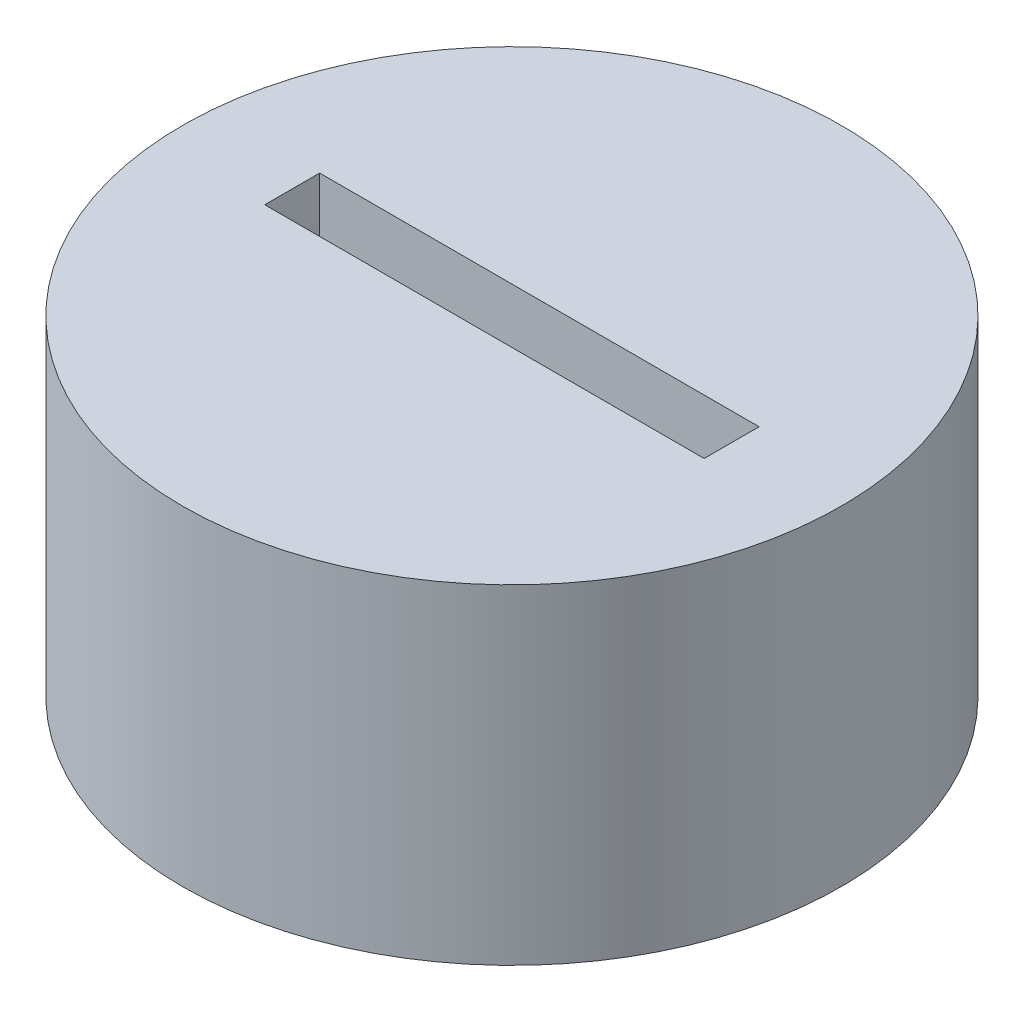
ISO-10303-21;
HEADER;
FILE_DESCRIPTION(('STEP AP214'),'2;1');
FILE_NAME('part.step','',(''),(''),'','','');
FILE_SCHEMA(('AUTOMOTIVE_DESIGN { 1 0 10303 214 1 1 1 1 }'));
ENDSEC;
DATA;
#1=APPLICATION_CONTEXT('core data for automotive mechanical design processes');
#2=APPLICATION_PROTOCOL_DEFINITION('international standard','automotive_design',2000,#1);
#3=PRODUCT_CONTEXT('',#1,'mechanical');
#4=PRODUCT('Part','Part','',(#3));
#5=PRODUCT_RELATED_PRODUCT_CATEGORY('part','',(#4));
#6=PRODUCT_DEFINITION_FORMATION('','',#4);
#7=PRODUCT_DEFINITION_CONTEXT('part definition',#1,'design');
#8=PRODUCT_DEFINITION('design','',#6,#7);
#9=PRODUCT_DEFINITION_SHAPE('','',#8);
#10=(LENGTH_UNIT() NAMED_UNIT(*) SI_UNIT(.MILLI.,.METRE.));
#11=(NAMED_UNIT(*) PLANE_ANGLE_UNIT() SI_UNIT($,.RADIAN.));
#12=(NAMED_UNIT(*) SI_UNIT($,.STERADIAN.) SOLID_ANGLE_UNIT());
#13=UNCERTAINTY_MEASURE_WITH_UNIT(LENGTH_MEASURE(1.E-05),#10,'distance_accuracy_value','');
#14=(GEOMETRIC_REPRESENTATION_CONTEXT(3) GLOBAL_UNCERTAINTY_ASSIGNED_CONTEXT((#13)) GLOBAL_UNIT_ASSIGNED_CONTEXT((#10,
#11,#12)) REPRESENTATION_CONTEXT('',''));
#15=CARTESIAN_POINT('',(0.,0.,0.));
#16=DIRECTION('',(0.,0.,1.));
#17=DIRECTION('',(1.,0.,0.));
#18=AXIS2_PLACEMENT_3D('',#15,#16,#17);
#19=CARTESIAN_POINT('',(0.,6.,0.));
#20=DIRECTION('',(0.,-1.,0.));
#21=DIRECTION('',(0.,0.,-1.));
#22=AXIS2_PLACEMENT_3D('',#19,#20,#21);
#23=CYLINDRICAL_SURFACE('',#22,6.);
#24=CARTESIAN_POINT('',(0.,6.,0.));
#25=DIRECTION('',(0.,1.,0.));
#26=DIRECTION('',(0.,0.,1.));
#27=AXIS2_PLACEMENT_3D('',#24,#25,#26);
#28=CIRCLE('',#27,6.);
#29=CARTESIAN_POINT('',(0.,6.,6.));
#30=VERTEX_POINT('',#29);
#31=EDGE_CURVE('E11',#30,#30,#28,.T.);
#32=ORIENTED_EDGE('',*,*,#31,.F.);
#33=EDGE_LOOP('',(#32));
#34=FACE_BOUND('',#33,.T.);
#35=CARTESIAN_POINT('',(0.,0.,0.));
#36=DIRECTION('',(0.,1.,0.));
#37=DIRECTION('',(0.,0.,1.));
#38=AXIS2_PLACEMENT_3D('',#35,#36,#37);
#39=CIRCLE('',#38,6.);
#40=CARTESIAN_POINT('',(0.,0.,6.));
#41=VERTEX_POINT('',#40);
#42=EDGE_CURVE('E39',#41,#41,#39,.T.);
#43=ORIENTED_EDGE('',*,*,#42,.T.);
#44=EDGE_LOOP('',(#43));
#45=FACE_BOUND('',#44,.T.);
#46=ADVANCED_FACE('F36',(#34,#45),#23,.T.);
#47=CARTESIAN_POINT('',(0.,6.,0.));
#48=DIRECTION('',(0.,1.,0.));
#49=DIRECTION('',(0.,0.,1.));
#50=AXIS2_PLACEMENT_3D('',#47,#48,#49);
#51=PLANE('',#50);
#52=DIRECTION('',(0.,0.,-1.));
#53=VECTOR('',#52,1.);
#54=CARTESIAN_POINT('',(4.,6.,0.5));
#55=LINE('',#54,#53);
#56=CARTESIAN_POINT('',(4.,6.,0.5));
#57=VERTEX_POINT('',#56);
#58=CARTESIAN_POINT('',(4.,6.,-0.5));
#59=VERTEX_POINT('',#58);
#60=EDGE_CURVE('E58',#57,#59,#55,.T.);
#61=ORIENTED_EDGE('',*,*,#60,.F.);
#62=DIRECTION('',(1.,0.,0.));
#63=VECTOR('',#62,1.);
#64=CARTESIAN_POINT('',(-4.,6.,0.5));
#65=LINE('',#64,#63);
#66=CARTESIAN_POINT('',(-4.,6.,0.5));
#67=VERTEX_POINT('',#66);
#68=EDGE_CURVE('E142',#67,#57,#65,.T.);
#69=ORIENTED_EDGE('',*,*,#68,.F.);
#70=DIRECTION('',(0.,0.,1.));
#71=VECTOR('',#70,1.);
#72=CARTESIAN_POINT('',(-4.,6.,0.5));
#73=LINE('',#72,#71);
#74=CARTESIAN_POINT('',(-4.,6.,-0.5));
#75=VERTEX_POINT('',#74);
#76=EDGE_CURVE('E156',#75,#67,#73,.T.);
#77=ORIENTED_EDGE('',*,*,#76,.F.);
#78=DIRECTION('',(-1.,0.,0.));
#79=VECTOR('',#78,1.);
#80=CARTESIAN_POINT('',(-4.,6.,-0.5));
#81=LINE('',#80,#79);
#82=EDGE_CURVE('E153',#59,#75,#81,.T.);
#83=ORIENTED_EDGE('',*,*,#82,.F.);
#84=EDGE_LOOP('',(#61,#69,#77,#83));
#85=FACE_BOUND('',#84,.T.);
#86=ORIENTED_EDGE('',*,*,#31,.T.);
#87=EDGE_LOOP('',(#86));
#88=FACE_BOUND('',#87,.T.);
#89=ADVANCED_FACE('F174',(#85,#88),#51,.T.);
#90=CARTESIAN_POINT('',(0.,0.,0.));
#91=DIRECTION('',(0.,1.,0.));
#92=DIRECTION('',(0.,0.,1.));
#93=AXIS2_PLACEMENT_3D('',#90,#91,#92);
#94=PLANE('',#93);
#95=DIRECTION('',(-1.,0.,0.));
#96=VECTOR('',#95,1.);
#97=CARTESIAN_POINT('',(-0.5,0.,4.));
#98=LINE('',#97,#96);
#99=CARTESIAN_POINT('',(0.5,0.,4.));
#100=VERTEX_POINT('',#99);
#101=CARTESIAN_POINT('',(-0.5,0.,4.));
#102=VERTEX_POINT('',#101);
#103=EDGE_CURVE('E129',#100,#102,#98,.T.);
#104=ORIENTED_EDGE('',*,*,#103,.F.);
#105=DIRECTION('',(0.,0.,1.));
#106=VECTOR('',#105,1.);
#107=CARTESIAN_POINT('',(0.5,0.,4.));
#108=LINE('',#107,#106);
#109=CARTESIAN_POINT('',(0.500000000000001,0.,-4.));
#110=VERTEX_POINT('',#109);
#111=EDGE_CURVE('E50',#110,#100,#108,.T.);
#112=ORIENTED_EDGE('',*,*,#111,.F.);
#113=DIRECTION('',(1.,0.,0.));
#114=VECTOR('',#113,1.);
#115=CARTESIAN_POINT('',(-0.499999999999999,0.,-4.));
#116=LINE('',#115,#114);
#117=CARTESIAN_POINT('',(-0.499999999999999,0.,-4.));
#118=VERTEX_POINT('',#117);
#119=EDGE_CURVE('E120',#118,#110,#116,.T.);
#120=ORIENTED_EDGE('',*,*,#119,.F.);
#121=DIRECTION('',(0.,0.,-1.));
#122=VECTOR('',#121,1.);
#123=CARTESIAN_POINT('',(-0.5,0.,4.));
#124=LINE('',#123,#122);
#125=EDGE_CURVE('E123',#102,#118,#124,.T.);
#126=ORIENTED_EDGE('',*,*,#125,.F.);
#127=EDGE_LOOP('',(#104,#112,#120,#126));
#128=FACE_BOUND('',#127,.T.);
#129=ORIENTED_EDGE('',*,*,#42,.F.);
#130=EDGE_LOOP('',(#129));
#131=FACE_BOUND('',#130,.T.);
#132=ADVANCED_FACE('F193',(#128,#131),#94,.F.);
#133=CARTESIAN_POINT('',(4.,4.5,0.5));
#134=DIRECTION('',(1.,0.,0.));
#135=DIRECTION('',(0.,0.,-1.));
#136=AXIS2_PLACEMENT_3D('',#133,#134,#135);
#137=PLANE('',#136);
#138=ORIENTED_EDGE('',*,*,#60,.T.);
#139=DIRECTION('',(0.,1.,0.));
#140=VECTOR('',#139,1.);
#141=CARTESIAN_POINT('',(4.,4.5,-0.5));
#142=LINE('',#141,#140);
#143=CARTESIAN_POINT('',(4.,4.5,-0.5));
#144=VERTEX_POINT('',#143);
#145=EDGE_CURVE('E151',#144,#59,#142,.T.);
#146=ORIENTED_EDGE('',*,*,#145,.F.);
#147=DIRECTION('',(0.,0.,-1.));
#148=VECTOR('',#147,1.);
#149=CARTESIAN_POINT('',(4.,4.5,0.5));
#150=LINE('',#149,#148);
#151=CARTESIAN_POINT('',(4.,4.5,0.5));
#152=VERTEX_POINT('',#151);
#153=EDGE_CURVE('E138',#152,#144,#150,.T.);
#154=ORIENTED_EDGE('',*,*,#153,.F.);
#155=DIRECTION('',(0.,1.,0.));
#156=VECTOR('',#155,1.);
#157=CARTESIAN_POINT('',(4.,4.5,0.5));
#158=LINE('',#157,#156);
#159=EDGE_CURVE('E161',#152,#57,#158,.T.);
#160=ORIENTED_EDGE('',*,*,#159,.T.);
#161=EDGE_LOOP('',(#138,#146,#154,#160));
#162=FACE_BOUND('',#161,.T.);
#163=ADVANCED_FACE('F183',(#162),#137,.F.);
#164=CARTESIAN_POINT('',(-4.,4.5,0.5));
#165=DIRECTION('',(0.,0.,1.));
#166=DIRECTION('',(1.,0.,0.));
#167=AXIS2_PLACEMENT_3D('',#164,#165,#166);
#168=PLANE('',#167);
#169=ORIENTED_EDGE('',*,*,#68,.T.);
#170=ORIENTED_EDGE('',*,*,#159,.F.);
#171=DIRECTION('',(1.,0.,0.));
#172=VECTOR('',#171,1.);
#173=CARTESIAN_POINT('',(-4.,4.5,0.5));
#174=LINE('',#173,#172);
#175=CARTESIAN_POINT('',(-4.,4.5,0.5));
#176=VERTEX_POINT('',#175);
#177=EDGE_CURVE('E148',#176,#152,#174,.T.);
#178=ORIENTED_EDGE('',*,*,#177,.F.);
#179=DIRECTION('',(0.,1.,0.));
#180=VECTOR('',#179,1.);
#181=CARTESIAN_POINT('',(-4.,4.5,0.5));
#182=LINE('',#181,#180);
#183=EDGE_CURVE('E163',#176,#67,#182,.T.);
#184=ORIENTED_EDGE('',*,*,#183,.T.);
#185=EDGE_LOOP('',(#169,#170,#178,#184));
#186=FACE_BOUND('',#185,.T.);
#187=ADVANCED_FACE('F185',(#186),#168,.F.);
#188=CARTESIAN_POINT('',(-4.,4.5,0.5));
#189=DIRECTION('',(-1.,0.,0.));
#190=DIRECTION('',(0.,0.,1.));
#191=AXIS2_PLACEMENT_3D('',#188,#189,#190);
#192=PLANE('',#191);
#193=ORIENTED_EDGE('',*,*,#76,.T.);
#194=ORIENTED_EDGE('',*,*,#183,.F.);
#195=DIRECTION('',(0.,0.,1.));
#196=VECTOR('',#195,1.);
#197=CARTESIAN_POINT('',(-4.,4.5,0.5));
#198=LINE('',#197,#196);
#199=CARTESIAN_POINT('',(-4.,4.5,-0.5));
#200=VERTEX_POINT('',#199);
#201=EDGE_CURVE('E145',#200,#176,#198,.T.);
#202=ORIENTED_EDGE('',*,*,#201,.F.);
#203=DIRECTION('',(0.,1.,0.));
#204=VECTOR('',#203,1.);
#205=CARTESIAN_POINT('',(-4.,4.5,-0.5));
#206=LINE('',#205,#204);
#207=EDGE_CURVE('E165',#200,#75,#206,.T.);
#208=ORIENTED_EDGE('',*,*,#207,.T.);
#209=EDGE_LOOP('',(#193,#194,#202,#208));
#210=FACE_BOUND('',#209,.T.);
#211=ADVANCED_FACE('F178',(#210),#192,.F.);
#212=CARTESIAN_POINT('',(-4.,4.5,-0.5));
#213=DIRECTION('',(0.,0.,-1.));
#214=DIRECTION('',(-1.,0.,0.));
#215=AXIS2_PLACEMENT_3D('',#212,#213,#214);
#216=PLANE('',#215);
#217=ORIENTED_EDGE('',*,*,#82,.T.);
#218=ORIENTED_EDGE('',*,*,#207,.F.);
#219=DIRECTION('',(-1.,0.,0.));
#220=VECTOR('',#219,1.);
#221=CARTESIAN_POINT('',(-4.,4.5,-0.5));
#222=LINE('',#221,#220);
#223=EDGE_CURVE('E141',#144,#200,#222,.T.);
#224=ORIENTED_EDGE('',*,*,#223,.F.);
#225=ORIENTED_EDGE('',*,*,#145,.T.);
#226=EDGE_LOOP('',(#217,#218,#224,#225));
#227=FACE_BOUND('',#226,.T.);
#228=ADVANCED_FACE('F170',(#227),#216,.F.);
#229=CARTESIAN_POINT('',(0.,4.5,0.));
#230=DIRECTION('',(0.,-1.,0.));
#231=DIRECTION('',(0.,0.,-1.));
#232=AXIS2_PLACEMENT_3D('',#229,#230,#231);
#233=PLANE('',#232);
#234=ORIENTED_EDGE('',*,*,#153,.T.);
#235=ORIENTED_EDGE('',*,*,#223,.T.);
#236=ORIENTED_EDGE('',*,*,#201,.T.);
#237=ORIENTED_EDGE('',*,*,#177,.T.);
#238=EDGE_LOOP('',(#234,#235,#236,#237));
#239=FACE_BOUND('',#238,.T.);
#240=ADVANCED_FACE('F182',(#239),#233,.F.);
#241=CARTESIAN_POINT('',(0.5,1.5,4.));
#242=DIRECTION('',(1.,0.,0.));
#243=DIRECTION('',(0.,0.,-1.));
#244=AXIS2_PLACEMENT_3D('',#241,#242,#243);
#245=PLANE('',#244);
#246=ORIENTED_EDGE('',*,*,#111,.T.);
#247=DIRECTION('',(0.,-1.,0.));
#248=VECTOR('',#247,1.);
#249=CARTESIAN_POINT('',(0.5,1.5,4.));
#250=LINE('',#249,#248);
#251=CARTESIAN_POINT('',(0.5,1.5,4.));
#252=VERTEX_POINT('',#251);
#253=EDGE_CURVE('E98',#252,#100,#250,.T.);
#254=ORIENTED_EDGE('',*,*,#253,.F.);
#255=DIRECTION('',(0.,0.,1.));
#256=VECTOR('',#255,1.);
#257=CARTESIAN_POINT('',(0.5,1.5,4.));
#258=LINE('',#257,#256);
#259=CARTESIAN_POINT('',(0.500000000000001,1.5,-4.));
#260=VERTEX_POINT('',#259);
#261=EDGE_CURVE('E102',#260,#252,#258,.T.);
#262=ORIENTED_EDGE('',*,*,#261,.F.);
#263=DIRECTION('',(0.,-1.,0.));
#264=VECTOR('',#263,1.);
#265=CARTESIAN_POINT('',(0.500000000000001,1.5,-4.));
#266=LINE('',#265,#264);
#267=EDGE_CURVE('E133',#260,#110,#266,.T.);
#268=ORIENTED_EDGE('',*,*,#267,.T.);
#269=EDGE_LOOP('',(#246,#254,#262,#268));
#270=FACE_BOUND('',#269,.T.);
#271=ADVANCED_FACE('F100',(#270),#245,.F.);
#272=CARTESIAN_POINT('',(-0.499999999999999,1.5,-4.));
#273=DIRECTION('',(0.,0.,-1.));
#274=DIRECTION('',(-1.,0.,0.));
#275=AXIS2_PLACEMENT_3D('',#272,#273,#274);
#276=PLANE('',#275);
#277=ORIENTED_EDGE('',*,*,#119,.T.);
#278=ORIENTED_EDGE('',*,*,#267,.F.);
#279=DIRECTION('',(1.,0.,0.));
#280=VECTOR('',#279,1.);
#281=CARTESIAN_POINT('',(-0.499999999999999,1.5,-4.));
#282=LINE('',#281,#280);
#283=CARTESIAN_POINT('',(-0.499999999999999,1.5,-4.));
#284=VERTEX_POINT('',#283);
#285=EDGE_CURVE('E108',#284,#260,#282,.T.);
#286=ORIENTED_EDGE('',*,*,#285,.F.);
#287=DIRECTION('',(0.,-1.,0.));
#288=VECTOR('',#287,1.);
#289=CARTESIAN_POINT('',(-0.499999999999999,1.5,-4.));
#290=LINE('',#289,#288);
#291=EDGE_CURVE('E135',#284,#118,#290,.T.);
#292=ORIENTED_EDGE('',*,*,#291,.T.);
#293=EDGE_LOOP('',(#277,#278,#286,#292));
#294=FACE_BOUND('',#293,.T.);
#295=ADVANCED_FACE('F219',(#294),#276,.F.);
#296=CARTESIAN_POINT('',(-0.5,1.5,4.));
#297=DIRECTION('',(-1.,0.,0.));
#298=DIRECTION('',(0.,0.,1.));
#299=AXIS2_PLACEMENT_3D('',#296,#297,#298);
#300=PLANE('',#299);
#301=ORIENTED_EDGE('',*,*,#125,.T.);
#302=ORIENTED_EDGE('',*,*,#291,.F.);
#303=DIRECTION('',(0.,0.,-1.));
#304=VECTOR('',#303,1.);
#305=CARTESIAN_POINT('',(-0.5,1.5,4.));
#306=LINE('',#305,#304);
#307=CARTESIAN_POINT('',(-0.5,1.5,4.));
#308=VERTEX_POINT('',#307);
#309=EDGE_CURVE('E116',#308,#284,#306,.T.);
#310=ORIENTED_EDGE('',*,*,#309,.F.);
#311=DIRECTION('',(0.,-1.,0.));
#312=VECTOR('',#311,1.);
#313=CARTESIAN_POINT('',(-0.5,1.5,4.));
#314=LINE('',#313,#312);
#315=EDGE_CURVE('E107',#308,#102,#314,.T.);
#316=ORIENTED_EDGE('',*,*,#315,.T.);
#317=EDGE_LOOP('',(#301,#302,#310,#316));
#318=FACE_BOUND('',#317,.T.);
#319=ADVANCED_FACE('F224',(#318),#300,.F.);
#320=CARTESIAN_POINT('',(-0.5,1.5,4.));
#321=DIRECTION('',(0.,0.,1.));
#322=DIRECTION('',(1.,0.,0.));
#323=AXIS2_PLACEMENT_3D('',#320,#321,#322);
#324=PLANE('',#323);
#325=ORIENTED_EDGE('',*,*,#103,.T.);
#326=ORIENTED_EDGE('',*,*,#315,.F.);
#327=DIRECTION('',(-1.,0.,0.));
#328=VECTOR('',#327,1.);
#329=CARTESIAN_POINT('',(-0.5,1.5,4.));
#330=LINE('',#329,#328);
#331=EDGE_CURVE('E111',#252,#308,#330,.T.);
#332=ORIENTED_EDGE('',*,*,#331,.F.);
#333=ORIENTED_EDGE('',*,*,#253,.T.);
#334=EDGE_LOOP('',(#325,#326,#332,#333));
#335=FACE_BOUND('',#334,.T.);
#336=ADVANCED_FACE('F112',(#335),#324,.F.);
#337=CARTESIAN_POINT('',(0.,1.5,0.));
#338=DIRECTION('',(0.,-1.,0.));
#339=DIRECTION('',(0.,0.,-1.));
#340=AXIS2_PLACEMENT_3D('',#337,#338,#339);
#341=PLANE('',#340);
#342=ORIENTED_EDGE('',*,*,#261,.T.);
#343=ORIENTED_EDGE('',*,*,#331,.T.);
#344=ORIENTED_EDGE('',*,*,#309,.T.);
#345=ORIENTED_EDGE('',*,*,#285,.T.);
#346=EDGE_LOOP('',(#342,#343,#344,#345));
#347=FACE_BOUND('',#346,.T.);
#348=ADVANCED_FACE('F118',(#347),#341,.T.);
#349=CLOSED_SHELL('',(#46,#89,#132,#163,#187,#211,#228,#240,#271,#295,#319,#336,#348));
#350=MANIFOLD_SOLID_BREP('B2',#349);
#351=ADVANCED_BREP_SHAPE_REPRESENTATION('',(#18,#350),#14);
#352=SHAPE_DEFINITION_REPRESENTATION(#9,#351);
ENDSEC;
END-ISO-10303-21;
